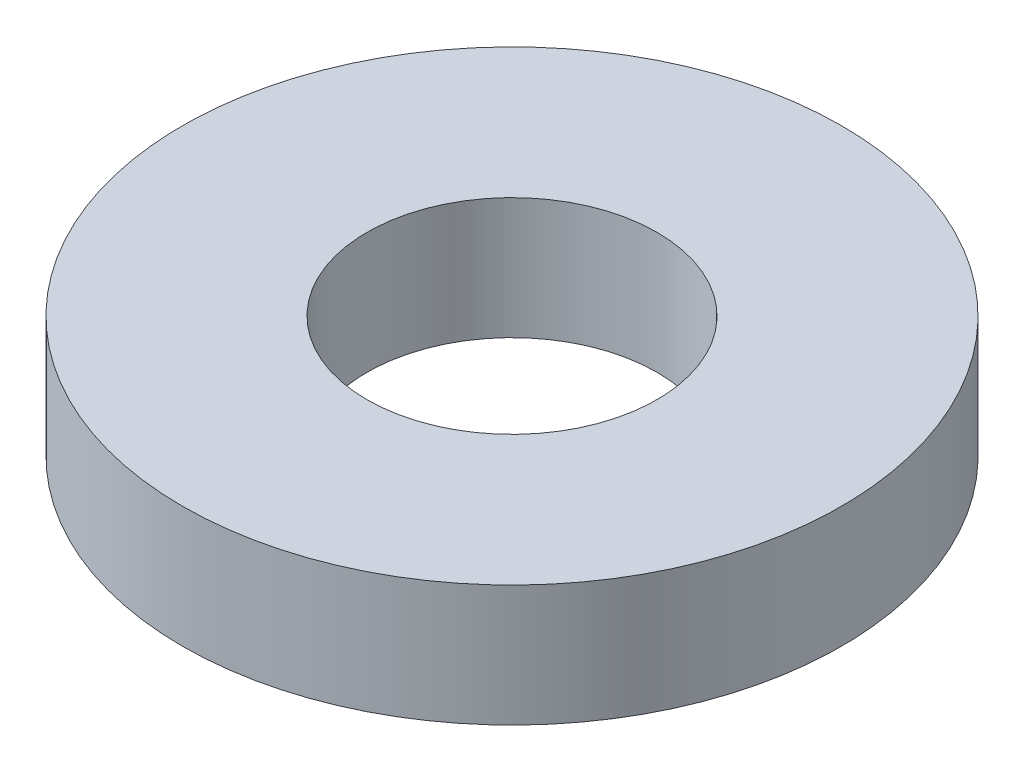
ISO-10303-21;
HEADER;
FILE_DESCRIPTION(('STEP AP214'),'2;1');
FILE_NAME('part.step','',(''),(''),'','','');
FILE_SCHEMA(('AUTOMOTIVE_DESIGN { 1 0 10303 214 1 1 1 1 }'));
ENDSEC;
DATA;
#1=APPLICATION_CONTEXT('core data for automotive mechanical design processes');
#2=APPLICATION_PROTOCOL_DEFINITION('international standard','automotive_design',2000,#1);
#3=PRODUCT_CONTEXT('',#1,'mechanical');
#4=PRODUCT('Part','Part','',(#3));
#5=PRODUCT_RELATED_PRODUCT_CATEGORY('part','',(#4));
#6=PRODUCT_DEFINITION_FORMATION('','',#4);
#7=PRODUCT_DEFINITION_CONTEXT('part definition',#1,'design');
#8=PRODUCT_DEFINITION('design','',#6,#7);
#9=PRODUCT_DEFINITION_SHAPE('','',#8);
#10=(LENGTH_UNIT() NAMED_UNIT(*) SI_UNIT(.MILLI.,.METRE.));
#11=(NAMED_UNIT(*) PLANE_ANGLE_UNIT() SI_UNIT($,.RADIAN.));
#12=(NAMED_UNIT(*) SI_UNIT($,.STERADIAN.) SOLID_ANGLE_UNIT());
#13=UNCERTAINTY_MEASURE_WITH_UNIT(LENGTH_MEASURE(1.E-05),#10,'distance_accuracy_value','');
#14=(GEOMETRIC_REPRESENTATION_CONTEXT(3) GLOBAL_UNCERTAINTY_ASSIGNED_CONTEXT((#13)) GLOBAL_UNIT_ASSIGNED_CONTEXT((#10,
#11,#12)) REPRESENTATION_CONTEXT('',''));
#15=CARTESIAN_POINT('',(0.,0.,0.));
#16=DIRECTION('',(0.,0.,1.));
#17=DIRECTION('',(1.,0.,0.));
#18=AXIS2_PLACEMENT_3D('',#15,#16,#17);
#19=CARTESIAN_POINT('',(0.,23.,0.));
#20=DIRECTION('',(0.,-1.,0.));
#21=DIRECTION('',(0.,0.,-1.));
#22=AXIS2_PLACEMENT_3D('',#19,#20,#21);
#23=CYLINDRICAL_SURFACE('',#22,62.5);
#24=CARTESIAN_POINT('',(0.,23.,0.));
#25=DIRECTION('',(0.,1.,0.));
#26=DIRECTION('',(0.,0.,1.));
#27=AXIS2_PLACEMENT_3D('',#24,#25,#26);
#28=CIRCLE('',#27,62.5);
#29=CARTESIAN_POINT('',(0.,23.,62.5));
#30=VERTEX_POINT('',#29);
#31=EDGE_CURVE('E10',#30,#30,#28,.T.);
#32=ORIENTED_EDGE('',*,*,#31,.F.);
#33=EDGE_LOOP('',(#32));
#34=FACE_BOUND('',#33,.T.);
#35=CARTESIAN_POINT('',(0.,0.,0.));
#36=DIRECTION('',(0.,1.,0.));
#37=DIRECTION('',(0.,0.,1.));
#38=AXIS2_PLACEMENT_3D('',#35,#36,#37);
#39=CIRCLE('',#38,62.5);
#40=CARTESIAN_POINT('',(0.,0.,62.5));
#41=VERTEX_POINT('',#40);
#42=EDGE_CURVE('E37',#41,#41,#39,.T.);
#43=ORIENTED_EDGE('',*,*,#42,.T.);
#44=EDGE_LOOP('',(#43));
#45=FACE_BOUND('',#44,.T.);
#46=ADVANCED_FACE('F40',(#34,#45),#23,.T.);
#47=CARTESIAN_POINT('',(0.,23.,0.));
#48=DIRECTION('',(0.,1.,0.));
#49=DIRECTION('',(0.,0.,1.));
#50=AXIS2_PLACEMENT_3D('',#47,#48,#49);
#51=PLANE('',#50);
#52=CARTESIAN_POINT('',(0.,23.,0.));
#53=DIRECTION('',(0.,1.,0.));
#54=DIRECTION('',(0.,0.,1.));
#55=AXIS2_PLACEMENT_3D('',#52,#53,#54);
#56=CIRCLE('',#55,27.5);
#57=CARTESIAN_POINT('',(0.,23.,27.5));
#58=VERTEX_POINT('',#57);
#59=EDGE_CURVE('E50',#58,#58,#56,.T.);
#60=ORIENTED_EDGE('',*,*,#59,.F.);
#61=EDGE_LOOP('',(#60));
#62=FACE_BOUND('',#61,.T.);
#63=ORIENTED_EDGE('',*,*,#31,.T.);
#64=EDGE_LOOP('',(#63));
#65=FACE_BOUND('',#64,.T.);
#66=ADVANCED_FACE('F59',(#62,#65),#51,.T.);
#67=CARTESIAN_POINT('',(0.,0.,0.));
#68=DIRECTION('',(0.,1.,0.));
#69=DIRECTION('',(0.,0.,1.));
#70=AXIS2_PLACEMENT_3D('',#67,#68,#69);
#71=PLANE('',#70);
#72=CARTESIAN_POINT('',(0.,0.,0.));
#73=DIRECTION('',(0.,1.,0.));
#74=DIRECTION('',(0.,0.,1.));
#75=AXIS2_PLACEMENT_3D('',#72,#73,#74);
#76=CIRCLE('',#75,27.5);
#77=CARTESIAN_POINT('',(0.,0.,27.5));
#78=VERTEX_POINT('',#77);
#79=EDGE_CURVE('E47',#78,#78,#76,.T.);
#80=ORIENTED_EDGE('',*,*,#79,.T.);
#81=EDGE_LOOP('',(#80));
#82=FACE_BOUND('',#81,.T.);
#83=ORIENTED_EDGE('',*,*,#42,.F.);
#84=EDGE_LOOP('',(#83));
#85=FACE_BOUND('',#84,.T.);
#86=ADVANCED_FACE('F58',(#82,#85),#71,.F.);
#87=CARTESIAN_POINT('',(0.,23.,0.));
#88=DIRECTION('',(0.,-1.,0.));
#89=DIRECTION('',(0.,0.,-1.));
#90=AXIS2_PLACEMENT_3D('',#87,#88,#89);
#91=CYLINDRICAL_SURFACE('',#90,27.5);
#92=ORIENTED_EDGE('',*,*,#59,.T.);
#93=EDGE_LOOP('',(#92));
#94=FACE_BOUND('',#93,.T.);
#95=ORIENTED_EDGE('',*,*,#79,.F.);
#96=EDGE_LOOP('',(#95));
#97=FACE_BOUND('',#96,.T.);
#98=ADVANCED_FACE('F54',(#94,#97),#91,.F.);
#99=CLOSED_SHELL('',(#46,#66,#86,#98));
#100=MANIFOLD_SOLID_BREP('B2',#99);
#101=ADVANCED_BREP_SHAPE_REPRESENTATION('',(#18,#100),#14);
#102=SHAPE_DEFINITION_REPRESENTATION(#9,#101);
ENDSEC;
END-ISO-10303-21;
